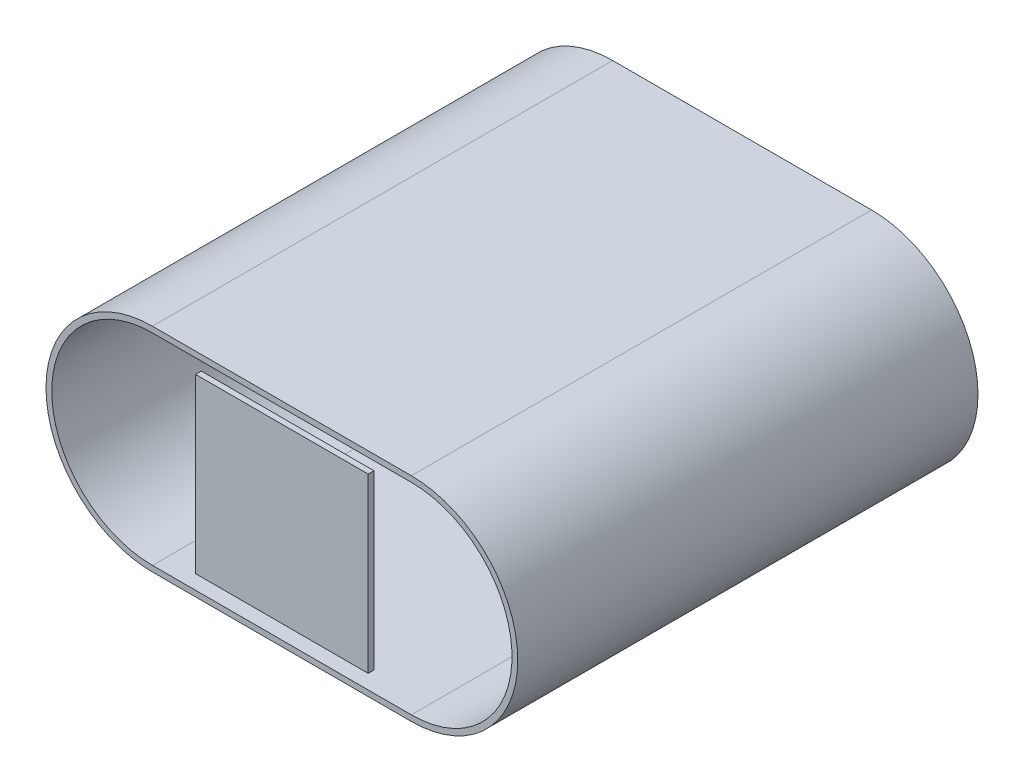
ISO-10303-21;
HEADER;
FILE_DESCRIPTION(('STEP AP214'),'2;1');
FILE_NAME('part.step','',(''),(''),'','','');
FILE_SCHEMA(('AUTOMOTIVE_DESIGN { 1 0 10303 214 1 1 1 1 }'));
ENDSEC;
DATA;
#1=APPLICATION_CONTEXT('core data for automotive mechanical design processes');
#2=APPLICATION_PROTOCOL_DEFINITION('international standard','automotive_design',2000,#1);
#3=PRODUCT_CONTEXT('',#1,'mechanical');
#4=PRODUCT('Part','Part','',(#3));
#5=PRODUCT_RELATED_PRODUCT_CATEGORY('part','',(#4));
#6=PRODUCT_DEFINITION_FORMATION('','',#4);
#7=PRODUCT_DEFINITION_CONTEXT('part definition',#1,'design');
#8=PRODUCT_DEFINITION('design','',#6,#7);
#9=PRODUCT_DEFINITION_SHAPE('','',#8);
#10=(LENGTH_UNIT() NAMED_UNIT(*) SI_UNIT(.MILLI.,.METRE.));
#11=(NAMED_UNIT(*) PLANE_ANGLE_UNIT() SI_UNIT($,.RADIAN.));
#12=(NAMED_UNIT(*) SI_UNIT($,.STERADIAN.) SOLID_ANGLE_UNIT());
#13=UNCERTAINTY_MEASURE_WITH_UNIT(LENGTH_MEASURE(1.E-05),#10,'distance_accuracy_value','');
#14=(GEOMETRIC_REPRESENTATION_CONTEXT(3) GLOBAL_UNCERTAINTY_ASSIGNED_CONTEXT((#13)) GLOBAL_UNIT_ASSIGNED_CONTEXT((#10,
#11,#12)) REPRESENTATION_CONTEXT('',''));
#15=CARTESIAN_POINT('',(0.,0.,0.));
#16=DIRECTION('',(0.,0.,1.));
#17=DIRECTION('',(1.,0.,0.));
#18=AXIS2_PLACEMENT_3D('',#15,#16,#17);
#19=CARTESIAN_POINT('',(15.,-15.,79.));
#20=DIRECTION('',(1.,0.,0.));
#21=DIRECTION('',(0.,0.,-1.));
#22=AXIS2_PLACEMENT_3D('',#19,#20,#21);
#23=PLANE('',#22);
#24=DIRECTION('',(0.,1.,0.));
#25=VECTOR('',#24,1.);
#26=CARTESIAN_POINT('',(15.,-15.,80.));
#27=LINE('',#26,#25);
#28=CARTESIAN_POINT('',(15.,-15.,80.));
#29=VERTEX_POINT('',#28);
#30=CARTESIAN_POINT('',(15.,15.,80.));
#31=VERTEX_POINT('',#30);
#32=EDGE_CURVE('E114',#29,#31,#27,.T.);
#33=ORIENTED_EDGE('',*,*,#32,.F.);
#34=DIRECTION('',(0.,0.,1.));
#35=VECTOR('',#34,1.);
#36=CARTESIAN_POINT('',(15.,-15.,79.));
#37=LINE('',#36,#35);
#38=CARTESIAN_POINT('',(15.,-15.,79.));
#39=VERTEX_POINT('',#38);
#40=EDGE_CURVE('E12',#39,#29,#37,.T.);
#41=ORIENTED_EDGE('',*,*,#40,.F.);
#42=DIRECTION('',(0.,1.,0.));
#43=VECTOR('',#42,1.);
#44=CARTESIAN_POINT('',(15.,-15.,79.));
#45=LINE('',#44,#43);
#46=CARTESIAN_POINT('',(15.,15.,79.));
#47=VERTEX_POINT('',#46);
#48=EDGE_CURVE('E108',#39,#47,#45,.T.);
#49=ORIENTED_EDGE('',*,*,#48,.T.);
#50=DIRECTION('',(0.,0.,1.));
#51=VECTOR('',#50,1.);
#52=CARTESIAN_POINT('',(15.,15.,79.));
#53=LINE('',#52,#51);
#54=EDGE_CURVE('E53',#47,#31,#53,.T.);
#55=ORIENTED_EDGE('',*,*,#54,.T.);
#56=EDGE_LOOP('',(#33,#41,#49,#55));
#57=FACE_BOUND('',#56,.T.);
#58=ADVANCED_FACE('F50',(#57),#23,.T.);
#59=CARTESIAN_POINT('',(-15.,-15.,79.));
#60=DIRECTION('',(0.,-1.,0.));
#61=DIRECTION('',(0.,0.,-1.));
#62=AXIS2_PLACEMENT_3D('',#59,#60,#61);
#63=PLANE('',#62);
#64=DIRECTION('',(1.,0.,0.));
#65=VECTOR('',#64,1.);
#66=CARTESIAN_POINT('',(-15.,-15.,80.));
#67=LINE('',#66,#65);
#68=CARTESIAN_POINT('',(-15.,-15.,80.));
#69=VERTEX_POINT('',#68);
#70=EDGE_CURVE('E110',#69,#29,#67,.T.);
#71=ORIENTED_EDGE('',*,*,#70,.F.);
#72=DIRECTION('',(0.,0.,1.));
#73=VECTOR('',#72,1.);
#74=CARTESIAN_POINT('',(-15.,-15.,79.));
#75=LINE('',#74,#73);
#76=CARTESIAN_POINT('',(-15.,-15.,79.));
#77=VERTEX_POINT('',#76);
#78=EDGE_CURVE('E59',#77,#69,#75,.T.);
#79=ORIENTED_EDGE('',*,*,#78,.F.);
#80=DIRECTION('',(1.,0.,0.));
#81=VECTOR('',#80,1.);
#82=CARTESIAN_POINT('',(-15.,-15.,79.));
#83=LINE('',#82,#81);
#84=EDGE_CURVE('E105',#77,#39,#83,.T.);
#85=ORIENTED_EDGE('',*,*,#84,.T.);
#86=ORIENTED_EDGE('',*,*,#40,.T.);
#87=EDGE_LOOP('',(#71,#79,#85,#86));
#88=FACE_BOUND('',#87,.T.);
#89=ADVANCED_FACE('F124',(#88),#63,.T.);
#90=CARTESIAN_POINT('',(-15.,-15.,79.));
#91=DIRECTION('',(-1.,0.,0.));
#92=DIRECTION('',(0.,-1.,0.));
#93=AXIS2_PLACEMENT_3D('',#90,#91,#92);
#94=PLANE('',#93);
#95=DIRECTION('',(0.,-1.,0.));
#96=VECTOR('',#95,1.);
#97=CARTESIAN_POINT('',(-15.,-15.,80.));
#98=LINE('',#97,#96);
#99=CARTESIAN_POINT('',(-15.,15.,80.));
#100=VERTEX_POINT('',#99);
#101=EDGE_CURVE('E100',#100,#69,#98,.T.);
#102=ORIENTED_EDGE('',*,*,#101,.F.);
#103=DIRECTION('',(0.,0.,1.));
#104=VECTOR('',#103,1.);
#105=CARTESIAN_POINT('',(-15.,15.,79.));
#106=LINE('',#105,#104);
#107=CARTESIAN_POINT('',(-15.,15.,79.));
#108=VERTEX_POINT('',#107);
#109=EDGE_CURVE('E95',#108,#100,#106,.T.);
#110=ORIENTED_EDGE('',*,*,#109,.F.);
#111=DIRECTION('',(0.,-1.,0.));
#112=VECTOR('',#111,1.);
#113=CARTESIAN_POINT('',(-15.,-15.,79.));
#114=LINE('',#113,#112);
#115=EDGE_CURVE('E98',#108,#77,#114,.T.);
#116=ORIENTED_EDGE('',*,*,#115,.T.);
#117=ORIENTED_EDGE('',*,*,#78,.T.);
#118=EDGE_LOOP('',(#102,#110,#116,#117));
#119=FACE_BOUND('',#118,.T.);
#120=ADVANCED_FACE('F97',(#119),#94,.T.);
#121=CARTESIAN_POINT('',(-15.,15.,79.));
#122=DIRECTION('',(0.,1.,0.));
#123=DIRECTION('',(-1.,0.,0.));
#124=AXIS2_PLACEMENT_3D('',#121,#122,#123);
#125=PLANE('',#124);
#126=DIRECTION('',(-1.,0.,0.));
#127=VECTOR('',#126,1.);
#128=CARTESIAN_POINT('',(-15.,15.,80.));
#129=LINE('',#128,#127);
#130=EDGE_CURVE('E117',#31,#100,#129,.T.);
#131=ORIENTED_EDGE('',*,*,#130,.F.);
#132=ORIENTED_EDGE('',*,*,#54,.F.);
#133=DIRECTION('',(-1.,0.,0.));
#134=VECTOR('',#133,1.);
#135=CARTESIAN_POINT('',(-15.,15.,79.));
#136=LINE('',#135,#134);
#137=EDGE_CURVE('E104',#47,#108,#136,.T.);
#138=ORIENTED_EDGE('',*,*,#137,.T.);
#139=ORIENTED_EDGE('',*,*,#109,.T.);
#140=EDGE_LOOP('',(#131,#132,#138,#139));
#141=FACE_BOUND('',#140,.T.);
#142=ADVANCED_FACE('F107',(#141),#125,.T.);
#143=CARTESIAN_POINT('',(0.,0.,79.));
#144=DIRECTION('',(0.,0.,-1.));
#145=DIRECTION('',(-1.,0.,0.));
#146=AXIS2_PLACEMENT_3D('',#143,#144,#145);
#147=PLANE('',#146);
#148=ORIENTED_EDGE('',*,*,#48,.F.);
#149=ORIENTED_EDGE('',*,*,#84,.F.);
#150=ORIENTED_EDGE('',*,*,#115,.F.);
#151=ORIENTED_EDGE('',*,*,#137,.F.);
#152=EDGE_LOOP('',(#148,#149,#150,#151));
#153=FACE_BOUND('',#152,.T.);
#154=ADVANCED_FACE('F103',(#153),#147,.T.);
#155=CARTESIAN_POINT('',(0.,0.,80.));
#156=DIRECTION('',(0.,0.,-1.));
#157=DIRECTION('',(-1.,0.,0.));
#158=AXIS2_PLACEMENT_3D('',#155,#156,#157);
#159=PLANE('',#158);
#160=ORIENTED_EDGE('',*,*,#32,.T.);
#161=ORIENTED_EDGE('',*,*,#130,.T.);
#162=ORIENTED_EDGE('',*,*,#101,.T.);
#163=ORIENTED_EDGE('',*,*,#70,.T.);
#164=EDGE_LOOP('',(#160,#161,#162,#163));
#165=FACE_BOUND('',#164,.T.);
#166=ADVANCED_FACE('F123',(#165),#159,.F.);
#167=CLOSED_SHELL('',(#58,#89,#120,#142,#154,#166));
#168=MANIFOLD_SOLID_BREP('B2',#167);
#169=CARTESIAN_POINT('',(-22.5,-17.5,1.));
#170=DIRECTION('',(-1.,0.,0.));
#171=DIRECTION('',(0.,0.,1.));
#172=AXIS2_PLACEMENT_3D('',#169,#170,#171);
#173=PLANE('',#172);
#174=DIRECTION('',(0.,1.,0.));
#175=VECTOR('',#174,1.);
#176=CARTESIAN_POINT('',(-22.5,-17.5,0.));
#177=LINE('',#176,#175);
#178=CARTESIAN_POINT('',(-22.5,-17.5,0.));
#179=VERTEX_POINT('',#178);
#180=CARTESIAN_POINT('',(-22.5,17.5,0.));
#181=VERTEX_POINT('',#180);
#182=EDGE_CURVE('E247',#179,#181,#177,.T.);
#183=ORIENTED_EDGE('',*,*,#182,.F.);
#184=DIRECTION('',(0.,0.,-1.));
#185=VECTOR('',#184,1.);
#186=CARTESIAN_POINT('',(-22.5,-17.5,1.));
#187=LINE('',#186,#185);
#188=CARTESIAN_POINT('',(-22.5,-17.5,1.));
#189=VERTEX_POINT('',#188);
#190=EDGE_CURVE('E48',#189,#179,#187,.T.);
#191=ORIENTED_EDGE('',*,*,#190,.F.);
#192=DIRECTION('',(0.,1.,0.));
#193=VECTOR('',#192,1.);
#194=CARTESIAN_POINT('',(-22.5,-17.5,1.));
#195=LINE('',#194,#193);
#196=CARTESIAN_POINT('',(-22.5,17.5,1.));
#197=VERTEX_POINT('',#196);
#198=EDGE_CURVE('E241',#189,#197,#195,.T.);
#199=ORIENTED_EDGE('',*,*,#198,.T.);
#200=DIRECTION('',(0.,0.,-1.));
#201=VECTOR('',#200,1.);
#202=CARTESIAN_POINT('',(-22.5,17.5,1.));
#203=LINE('',#202,#201);
#204=EDGE_CURVE('E186',#197,#181,#203,.T.);
#205=ORIENTED_EDGE('',*,*,#204,.T.);
#206=EDGE_LOOP('',(#183,#191,#199,#205));
#207=FACE_BOUND('',#206,.T.);
#208=ADVANCED_FACE('F183',(#207),#173,.T.);
#209=CARTESIAN_POINT('',(22.5,-17.5,1.));
#210=DIRECTION('',(0.,-1.,0.));
#211=DIRECTION('',(0.,0.,-1.));
#212=AXIS2_PLACEMENT_3D('',#209,#210,#211);
#213=PLANE('',#212);
#214=DIRECTION('',(-1.,0.,0.));
#215=VECTOR('',#214,1.);
#216=CARTESIAN_POINT('',(22.5,-17.5,0.));
#217=LINE('',#216,#215);
#218=CARTESIAN_POINT('',(22.5,-17.5,0.));
#219=VERTEX_POINT('',#218);
#220=EDGE_CURVE('E243',#219,#179,#217,.T.);
#221=ORIENTED_EDGE('',*,*,#220,.F.);
#222=DIRECTION('',(0.,0.,-1.));
#223=VECTOR('',#222,1.);
#224=CARTESIAN_POINT('',(22.5,-17.5,1.));
#225=LINE('',#224,#223);
#226=CARTESIAN_POINT('',(22.5,-17.5,1.));
#227=VERTEX_POINT('',#226);
#228=EDGE_CURVE('E192',#227,#219,#225,.T.);
#229=ORIENTED_EDGE('',*,*,#228,.F.);
#230=DIRECTION('',(-1.,0.,0.));
#231=VECTOR('',#230,1.);
#232=CARTESIAN_POINT('',(22.5,-17.5,1.));
#233=LINE('',#232,#231);
#234=EDGE_CURVE('E238',#227,#189,#233,.T.);
#235=ORIENTED_EDGE('',*,*,#234,.T.);
#236=ORIENTED_EDGE('',*,*,#190,.T.);
#237=EDGE_LOOP('',(#221,#229,#235,#236));
#238=FACE_BOUND('',#237,.T.);
#239=ADVANCED_FACE('F257',(#238),#213,.T.);
#240=CARTESIAN_POINT('',(22.5,-17.5,1.));
#241=DIRECTION('',(1.,0.,0.));
#242=DIRECTION('',(0.,1.,0.));
#243=AXIS2_PLACEMENT_3D('',#240,#241,#242);
#244=PLANE('',#243);
#245=DIRECTION('',(0.,-1.,0.));
#246=VECTOR('',#245,1.);
#247=CARTESIAN_POINT('',(22.5,-17.5,0.));
#248=LINE('',#247,#246);
#249=CARTESIAN_POINT('',(22.5,17.5,0.));
#250=VERTEX_POINT('',#249);
#251=EDGE_CURVE('E233',#250,#219,#248,.T.);
#252=ORIENTED_EDGE('',*,*,#251,.F.);
#253=DIRECTION('',(0.,0.,-1.));
#254=VECTOR('',#253,1.);
#255=CARTESIAN_POINT('',(22.5,17.5,1.));
#256=LINE('',#255,#254);
#257=CARTESIAN_POINT('',(22.5,17.5,1.));
#258=VERTEX_POINT('',#257);
#259=EDGE_CURVE('E228',#258,#250,#256,.T.);
#260=ORIENTED_EDGE('',*,*,#259,.F.);
#261=DIRECTION('',(0.,-1.,0.));
#262=VECTOR('',#261,1.);
#263=CARTESIAN_POINT('',(22.5,-17.5,1.));
#264=LINE('',#263,#262);
#265=EDGE_CURVE('E231',#258,#227,#264,.T.);
#266=ORIENTED_EDGE('',*,*,#265,.T.);
#267=ORIENTED_EDGE('',*,*,#228,.T.);
#268=EDGE_LOOP('',(#252,#260,#266,#267));
#269=FACE_BOUND('',#268,.T.);
#270=ADVANCED_FACE('F230',(#269),#244,.T.);
#271=CARTESIAN_POINT('',(22.5,17.5,1.));
#272=DIRECTION('',(0.,1.,0.));
#273=DIRECTION('',(0.,0.,1.));
#274=AXIS2_PLACEMENT_3D('',#271,#272,#273);
#275=PLANE('',#274);
#276=DIRECTION('',(1.,0.,0.));
#277=VECTOR('',#276,1.);
#278=CARTESIAN_POINT('',(22.5,17.5,0.));
#279=LINE('',#278,#277);
#280=EDGE_CURVE('E250',#181,#250,#279,.T.);
#281=ORIENTED_EDGE('',*,*,#280,.F.);
#282=ORIENTED_EDGE('',*,*,#204,.F.);
#283=DIRECTION('',(1.,0.,0.));
#284=VECTOR('',#283,1.);
#285=CARTESIAN_POINT('',(22.5,17.5,1.));
#286=LINE('',#285,#284);
#287=EDGE_CURVE('E237',#197,#258,#286,.T.);
#288=ORIENTED_EDGE('',*,*,#287,.T.);
#289=ORIENTED_EDGE('',*,*,#259,.T.);
#290=EDGE_LOOP('',(#281,#282,#288,#289));
#291=FACE_BOUND('',#290,.T.);
#292=ADVANCED_FACE('F240',(#291),#275,.T.);
#293=CARTESIAN_POINT('',(0.,0.,1.));
#294=DIRECTION('',(0.,0.,1.));
#295=DIRECTION('',(1.,0.,0.));
#296=AXIS2_PLACEMENT_3D('',#293,#294,#295);
#297=PLANE('',#296);
#298=ORIENTED_EDGE('',*,*,#198,.F.);
#299=ORIENTED_EDGE('',*,*,#234,.F.);
#300=ORIENTED_EDGE('',*,*,#265,.F.);
#301=ORIENTED_EDGE('',*,*,#287,.F.);
#302=EDGE_LOOP('',(#298,#299,#300,#301));
#303=FACE_BOUND('',#302,.T.);
#304=ADVANCED_FACE('F236',(#303),#297,.T.);
#305=CARTESIAN_POINT('',(0.,0.,0.));
#306=DIRECTION('',(0.,0.,1.));
#307=DIRECTION('',(1.,0.,0.));
#308=AXIS2_PLACEMENT_3D('',#305,#306,#307);
#309=PLANE('',#308);
#310=ORIENTED_EDGE('',*,*,#182,.T.);
#311=ORIENTED_EDGE('',*,*,#280,.T.);
#312=ORIENTED_EDGE('',*,*,#251,.T.);
#313=ORIENTED_EDGE('',*,*,#220,.T.);
#314=EDGE_LOOP('',(#310,#311,#312,#313));
#315=FACE_BOUND('',#314,.T.);
#316=ADVANCED_FACE('F256',(#315),#309,.F.);
#317=CLOSED_SHELL('',(#208,#239,#270,#292,#304,#316));
#318=MANIFOLD_SOLID_BREP('B6',#317);
#319=CARTESIAN_POINT('',(0.,-18.5,80.));
#320=DIRECTION('',(0.,1.,0.));
#321=DIRECTION('',(0.,0.,1.));
#322=AXIS2_PLACEMENT_3D('',#319,#320,#321);
#323=PLANE('',#322);
#324=DIRECTION('',(1.,0.,0.));
#325=VECTOR('',#324,1.);
#326=CARTESIAN_POINT('',(0.,-18.5,0.));
#327=LINE('',#326,#325);
#328=CARTESIAN_POINT('',(-22.5,-18.5,0.));
#329=VERTEX_POINT('',#328);
#330=CARTESIAN_POINT('',(22.5,-18.5,0.));
#331=VERTEX_POINT('',#330);
#332=EDGE_CURVE('E392',#329,#331,#327,.T.);
#333=ORIENTED_EDGE('',*,*,#332,.T.);
#334=DIRECTION('',(0.,0.,-1.));
#335=VECTOR('',#334,1.);
#336=CARTESIAN_POINT('',(22.5,-18.5,80.));
#337=LINE('',#336,#335);
#338=CARTESIAN_POINT('',(22.5,-18.5,80.));
#339=VERTEX_POINT('',#338);
#340=EDGE_CURVE('E315',#339,#331,#337,.T.);
#341=ORIENTED_EDGE('',*,*,#340,.F.);
#342=DIRECTION('',(1.,0.,0.));
#343=VECTOR('',#342,1.);
#344=CARTESIAN_POINT('',(0.,-18.5,80.));
#345=LINE('',#344,#343);
#346=CARTESIAN_POINT('',(-22.5,-18.5,80.));
#347=VERTEX_POINT('',#346);
#348=EDGE_CURVE('E357',#347,#339,#345,.T.);
#349=ORIENTED_EDGE('',*,*,#348,.F.);
#350=DIRECTION('',(0.,0.,-1.));
#351=VECTOR('',#350,1.);
#352=CARTESIAN_POINT('',(-22.5,-18.5,80.));
#353=LINE('',#352,#351);
#354=EDGE_CURVE('E430',#347,#329,#353,.T.);
#355=ORIENTED_EDGE('',*,*,#354,.T.);
#356=EDGE_LOOP('',(#333,#341,#349,#355));
#357=FACE_BOUND('',#356,.T.);
#358=ADVANCED_FACE('F307',(#357),#323,.F.);
#359=CARTESIAN_POINT('',(22.5,0.,80.));
#360=DIRECTION('',(0.,0.,-1.));
#361=DIRECTION('',(-1.,0.,0.));
#362=AXIS2_PLACEMENT_3D('',#359,#360,#361);
#363=CYLINDRICAL_SURFACE('',#362,18.5);
#364=CARTESIAN_POINT('',(22.5,0.,0.));
#365=DIRECTION('',(0.,0.,1.));
#366=DIRECTION('',(1.,0.,0.));
#367=AXIS2_PLACEMENT_3D('',#364,#365,#366);
#368=CIRCLE('',#367,18.5);
#369=CARTESIAN_POINT('',(22.5,18.5,0.));
#370=VERTEX_POINT('',#369);
#371=EDGE_CURVE('E433',#370,#331,#368,.F.);
#372=ORIENTED_EDGE('',*,*,#371,.F.);
#373=DIRECTION('',(0.,0.,-1.));
#374=VECTOR('',#373,1.);
#375=CARTESIAN_POINT('',(22.5,18.5,80.));
#376=LINE('',#375,#374);
#377=CARTESIAN_POINT('',(22.5,18.5,80.));
#378=VERTEX_POINT('',#377);
#379=EDGE_CURVE('E443',#378,#370,#376,.T.);
#380=ORIENTED_EDGE('',*,*,#379,.F.);
#381=CARTESIAN_POINT('',(22.5,0.,80.));
#382=DIRECTION('',(0.,0.,1.));
#383=DIRECTION('',(1.,0.,0.));
#384=AXIS2_PLACEMENT_3D('',#381,#382,#383);
#385=CIRCLE('',#384,18.5);
#386=EDGE_CURVE('E423',#378,#339,#385,.F.);
#387=ORIENTED_EDGE('',*,*,#386,.T.);
#388=ORIENTED_EDGE('',*,*,#340,.T.);
#389=EDGE_LOOP('',(#372,#380,#387,#388));
#390=FACE_BOUND('',#389,.T.);
#391=ADVANCED_FACE('F447',(#390),#363,.T.);
#392=CARTESIAN_POINT('',(0.,18.5,80.));
#393=DIRECTION('',(0.,1.,0.));
#394=DIRECTION('',(0.,0.,1.));
#395=AXIS2_PLACEMENT_3D('',#392,#393,#394);
#396=PLANE('',#395);
#397=DIRECTION('',(1.,0.,0.));
#398=VECTOR('',#397,1.);
#399=CARTESIAN_POINT('',(0.,18.5,0.));
#400=LINE('',#399,#398);
#401=CARTESIAN_POINT('',(-22.5,18.5,0.));
#402=VERTEX_POINT('',#401);
#403=EDGE_CURVE('E436',#402,#370,#400,.T.);
#404=ORIENTED_EDGE('',*,*,#403,.F.);
#405=DIRECTION('',(0.,0.,-1.));
#406=VECTOR('',#405,1.);
#407=CARTESIAN_POINT('',(-22.5,18.5,80.));
#408=LINE('',#407,#406);
#409=CARTESIAN_POINT('',(-22.5,18.5,80.));
#410=VERTEX_POINT('',#409);
#411=EDGE_CURVE('E441',#410,#402,#408,.T.);
#412=ORIENTED_EDGE('',*,*,#411,.F.);
#413=DIRECTION('',(1.,0.,0.));
#414=VECTOR('',#413,1.);
#415=CARTESIAN_POINT('',(0.,18.5,80.));
#416=LINE('',#415,#414);
#417=EDGE_CURVE('E426',#410,#378,#416,.T.);
#418=ORIENTED_EDGE('',*,*,#417,.T.);
#419=ORIENTED_EDGE('',*,*,#379,.T.);
#420=EDGE_LOOP('',(#404,#412,#418,#419));
#421=FACE_BOUND('',#420,.T.);
#422=ADVANCED_FACE('F455',(#421),#396,.T.);
#423=CARTESIAN_POINT('',(-22.5,0.,80.));
#424=DIRECTION('',(0.,0.,-1.));
#425=DIRECTION('',(-1.,0.,0.));
#426=AXIS2_PLACEMENT_3D('',#423,#424,#425);
#427=CYLINDRICAL_SURFACE('',#426,18.5);
#428=CARTESIAN_POINT('',(-22.5,0.,0.));
#429=DIRECTION('',(0.,0.,1.));
#430=DIRECTION('',(1.,0.,0.));
#431=AXIS2_PLACEMENT_3D('',#428,#429,#430);
#432=CIRCLE('',#431,18.5);
#433=EDGE_CURVE('E352',#402,#329,#432,.T.);
#434=ORIENTED_EDGE('',*,*,#433,.T.);
#435=ORIENTED_EDGE('',*,*,#354,.F.);
#436=CARTESIAN_POINT('',(-22.5,0.,80.));
#437=DIRECTION('',(0.,0.,1.));
#438=DIRECTION('',(1.,0.,0.));
#439=AXIS2_PLACEMENT_3D('',#436,#437,#438);
#440=CIRCLE('',#439,18.5);
#441=EDGE_CURVE('E331',#410,#347,#440,.T.);
#442=ORIENTED_EDGE('',*,*,#441,.F.);
#443=ORIENTED_EDGE('',*,*,#411,.T.);
#444=EDGE_LOOP('',(#434,#435,#442,#443));
#445=FACE_BOUND('',#444,.T.);
#446=ADVANCED_FACE('F458',(#445),#427,.T.);
#447=CARTESIAN_POINT('',(0.,0.,80.));
#448=DIRECTION('',(0.,0.,1.));
#449=DIRECTION('',(1.,0.,0.));
#450=AXIS2_PLACEMENT_3D('',#447,#448,#449);
#451=PLANE('',#450);
#452=DIRECTION('',(1.,0.,0.));
#453=VECTOR('',#452,1.);
#454=CARTESIAN_POINT('',(0.,-17.5,80.));
#455=LINE('',#454,#453);
#456=CARTESIAN_POINT('',(-22.5,-17.5,80.));
#457=VERTEX_POINT('',#456);
#458=CARTESIAN_POINT('',(22.5,-17.5,80.));
#459=VERTEX_POINT('',#458);
#460=EDGE_CURVE('E387',#457,#459,#455,.T.);
#461=ORIENTED_EDGE('',*,*,#460,.F.);
#462=CARTESIAN_POINT('',(-22.5,0.,80.));
#463=DIRECTION('',(0.,0.,1.));
#464=DIRECTION('',(1.,0.,0.));
#465=AXIS2_PLACEMENT_3D('',#462,#463,#464);
#466=CIRCLE('',#465,17.5);
#467=CARTESIAN_POINT('',(-22.5,17.5,80.));
#468=VERTEX_POINT('',#467);
#469=EDGE_CURVE('E420',#468,#457,#466,.T.);
#470=ORIENTED_EDGE('',*,*,#469,.F.);
#471=DIRECTION('',(1.,0.,0.));
#472=VECTOR('',#471,1.);
#473=CARTESIAN_POINT('',(0.,17.5,80.));
#474=LINE('',#473,#472);
#475=CARTESIAN_POINT('',(22.5,17.5,80.));
#476=VERTEX_POINT('',#475);
#477=EDGE_CURVE('E322',#468,#476,#474,.T.);
#478=ORIENTED_EDGE('',*,*,#477,.T.);
#479=CARTESIAN_POINT('',(22.5,0.,80.));
#480=DIRECTION('',(0.,0.,1.));
#481=DIRECTION('',(1.,0.,0.));
#482=AXIS2_PLACEMENT_3D('',#479,#480,#481);
#483=CIRCLE('',#482,17.5);
#484=EDGE_CURVE('E417',#476,#459,#483,.F.);
#485=ORIENTED_EDGE('',*,*,#484,.T.);
#486=EDGE_LOOP('',(#461,#470,#478,#485));
#487=FACE_BOUND('',#486,.T.);
#488=ORIENTED_EDGE('',*,*,#348,.T.);
#489=ORIENTED_EDGE('',*,*,#386,.F.);
#490=ORIENTED_EDGE('',*,*,#417,.F.);
#491=ORIENTED_EDGE('',*,*,#441,.T.);
#492=EDGE_LOOP('',(#488,#489,#490,#491));
#493=FACE_BOUND('',#492,.T.);
#494=ADVANCED_FACE('F456',(#487,#493),#451,.T.);
#495=CARTESIAN_POINT('',(0.,0.,0.));
#496=DIRECTION('',(0.,0.,1.));
#497=DIRECTION('',(1.,0.,0.));
#498=AXIS2_PLACEMENT_3D('',#495,#496,#497);
#499=PLANE('',#498);
#500=ORIENTED_EDGE('',*,*,#332,.F.);
#501=ORIENTED_EDGE('',*,*,#433,.F.);
#502=ORIENTED_EDGE('',*,*,#403,.T.);
#503=ORIENTED_EDGE('',*,*,#371,.T.);
#504=EDGE_LOOP('',(#500,#501,#502,#503));
#505=FACE_BOUND('',#504,.T.);
#506=CARTESIAN_POINT('',(0.,0.,0.));
#507=DIRECTION('',(0.,0.,1.));
#508=DIRECTION('',(1.,0.,0.));
#509=AXIS2_PLACEMENT_3D('',#506,#507,#508);
#510=CIRCLE('',#509,1.25);
#511=CARTESIAN_POINT('',(1.25,0.,0.));
#512=VERTEX_POINT('',#511);
#513=EDGE_CURVE('E181',#512,#512,#510,.F.);
#514=ORIENTED_EDGE('',*,*,#513,.F.);
#515=EDGE_LOOP('',(#514));
#516=FACE_BOUND('',#515,.T.);
#517=ADVANCED_FACE('F451',(#505,#516),#499,.F.);
#518=CARTESIAN_POINT('',(0.,-17.5,80.));
#519=DIRECTION('',(0.,1.,0.));
#520=DIRECTION('',(0.,0.,1.));
#521=AXIS2_PLACEMENT_3D('',#518,#519,#520);
#522=PLANE('',#521);
#523=DIRECTION('',(1.,0.,0.));
#524=VECTOR('',#523,1.);
#525=CARTESIAN_POINT('',(0.,-17.5,1.));
#526=LINE('',#525,#524);
#527=CARTESIAN_POINT('',(-22.5,-17.5,1.));
#528=VERTEX_POINT('',#527);
#529=CARTESIAN_POINT('',(22.5,-17.5,1.));
#530=VERTEX_POINT('',#529);
#531=EDGE_CURVE('E385',#528,#530,#526,.T.);
#532=ORIENTED_EDGE('',*,*,#531,.F.);
#533=DIRECTION('',(0.,0.,1.));
#534=VECTOR('',#533,1.);
#535=CARTESIAN_POINT('',(-22.5,-17.5,80.));
#536=LINE('',#535,#534);
#537=EDGE_CURVE('E411',#457,#528,#536,.F.);
#538=ORIENTED_EDGE('',*,*,#537,.F.);
#539=ORIENTED_EDGE('',*,*,#460,.T.);
#540=DIRECTION('',(0.,0.,-1.));
#541=VECTOR('',#540,1.);
#542=CARTESIAN_POINT('',(22.5,-17.5,80.));
#543=LINE('',#542,#541);
#544=EDGE_CURVE('E381',#459,#530,#543,.T.);
#545=ORIENTED_EDGE('',*,*,#544,.T.);
#546=EDGE_LOOP('',(#532,#538,#539,#545));
#547=FACE_BOUND('',#546,.T.);
#548=ADVANCED_FACE('F383',(#547),#522,.T.);
#549=CARTESIAN_POINT('',(22.5,0.,80.));
#550=DIRECTION('',(0.,0.,-1.));
#551=DIRECTION('',(-1.,0.,0.));
#552=AXIS2_PLACEMENT_3D('',#549,#550,#551);
#553=CYLINDRICAL_SURFACE('',#552,17.5);
#554=CARTESIAN_POINT('',(22.5,0.,1.));
#555=DIRECTION('',(0.,0.,1.));
#556=DIRECTION('',(1.,0.,0.));
#557=AXIS2_PLACEMENT_3D('',#554,#555,#556);
#558=CIRCLE('',#557,17.5);
#559=CARTESIAN_POINT('',(22.5,17.5,1.));
#560=VERTEX_POINT('',#559);
#561=EDGE_CURVE('E399',#560,#530,#558,.F.);
#562=ORIENTED_EDGE('',*,*,#561,.T.);
#563=ORIENTED_EDGE('',*,*,#544,.F.);
#564=ORIENTED_EDGE('',*,*,#484,.F.);
#565=DIRECTION('',(0.,0.,1.));
#566=VECTOR('',#565,1.);
#567=CARTESIAN_POINT('',(22.5,17.5,80.));
#568=LINE('',#567,#566);
#569=EDGE_CURVE('E393',#476,#560,#568,.F.);
#570=ORIENTED_EDGE('',*,*,#569,.T.);
#571=EDGE_LOOP('',(#562,#563,#564,#570));
#572=FACE_BOUND('',#571,.T.);
#573=ADVANCED_FACE('F405',(#572),#553,.F.);
#574=CARTESIAN_POINT('',(0.,17.5,80.));
#575=DIRECTION('',(0.,1.,0.));
#576=DIRECTION('',(0.,0.,1.));
#577=AXIS2_PLACEMENT_3D('',#574,#575,#576);
#578=PLANE('',#577);
#579=DIRECTION('',(1.,0.,0.));
#580=VECTOR('',#579,1.);
#581=CARTESIAN_POINT('',(0.,17.5,1.));
#582=LINE('',#581,#580);
#583=CARTESIAN_POINT('',(-22.5,17.5,1.));
#584=VERTEX_POINT('',#583);
#585=EDGE_CURVE('E406',#584,#560,#582,.T.);
#586=ORIENTED_EDGE('',*,*,#585,.T.);
#587=ORIENTED_EDGE('',*,*,#569,.F.);
#588=ORIENTED_EDGE('',*,*,#477,.F.);
#589=DIRECTION('',(0.,0.,-1.));
#590=VECTOR('',#589,1.);
#591=CARTESIAN_POINT('',(-22.5,17.5,80.));
#592=LINE('',#591,#590);
#593=EDGE_CURVE('E412',#468,#584,#592,.T.);
#594=ORIENTED_EDGE('',*,*,#593,.T.);
#595=EDGE_LOOP('',(#586,#587,#588,#594));
#596=FACE_BOUND('',#595,.T.);
#597=ADVANCED_FACE('F507',(#596),#578,.F.);
#598=CARTESIAN_POINT('',(-22.5,0.,80.));
#599=DIRECTION('',(0.,0.,-1.));
#600=DIRECTION('',(-1.,0.,0.));
#601=AXIS2_PLACEMENT_3D('',#598,#599,#600);
#602=CYLINDRICAL_SURFACE('',#601,17.5);
#603=CARTESIAN_POINT('',(-22.5,0.,1.));
#604=DIRECTION('',(0.,0.,1.));
#605=DIRECTION('',(1.,0.,0.));
#606=AXIS2_PLACEMENT_3D('',#603,#604,#605);
#607=CIRCLE('',#606,17.5);
#608=EDGE_CURVE('E402',#584,#528,#607,.T.);
#609=ORIENTED_EDGE('',*,*,#608,.F.);
#610=ORIENTED_EDGE('',*,*,#593,.F.);
#611=ORIENTED_EDGE('',*,*,#469,.T.);
#612=ORIENTED_EDGE('',*,*,#537,.T.);
#613=EDGE_LOOP('',(#609,#610,#611,#612));
#614=FACE_BOUND('',#613,.T.);
#615=ADVANCED_FACE('F516',(#614),#602,.F.);
#616=CARTESIAN_POINT('',(0.,0.,1.));
#617=DIRECTION('',(0.,0.,1.));
#618=DIRECTION('',(1.,0.,0.));
#619=AXIS2_PLACEMENT_3D('',#616,#617,#618);
#620=PLANE('',#619);
#621=ORIENTED_EDGE('',*,*,#585,.F.);
#622=ORIENTED_EDGE('',*,*,#608,.T.);
#623=ORIENTED_EDGE('',*,*,#531,.T.);
#624=ORIENTED_EDGE('',*,*,#561,.F.);
#625=EDGE_LOOP('',(#621,#622,#623,#624));
#626=FACE_BOUND('',#625,.T.);
#627=ADVANCED_FACE('F398',(#626),#620,.T.);
#628=CARTESIAN_POINT('',(0.,0.,-15.));
#629=DIRECTION('',(0.,0.,1.));
#630=DIRECTION('',(1.,0.,0.));
#631=AXIS2_PLACEMENT_3D('',#628,#629,#630);
#632=CYLINDRICAL_SURFACE('',#631,1.25);
#633=CARTESIAN_POINT('',(0.,0.,-12.8365737252465));
#634=DIRECTION('',(0.,0.,-1.));
#635=DIRECTION('',(-1.,0.,0.));
#636=AXIS2_PLACEMENT_3D('',#633,#634,#635);
#637=CIRCLE('',#636,1.25);
#638=CARTESIAN_POINT('',(-1.25,0.,-12.8365737252465));
#639=VERTEX_POINT('',#638);
#640=EDGE_CURVE('E310',#639,#639,#637,.F.);
#641=ORIENTED_EDGE('',*,*,#640,.T.);
#642=EDGE_LOOP('',(#641));
#643=FACE_BOUND('',#642,.T.);
#644=ORIENTED_EDGE('',*,*,#513,.T.);
#645=EDGE_LOOP('',(#644));
#646=FACE_BOUND('',#645,.T.);
#647=ADVANCED_FACE('F541',(#643,#646),#632,.T.);
#648=CARTESIAN_POINT('',(0.,0.,-15.));
#649=DIRECTION('',(0.,1.,0.));
#650=DIRECTION('',(-1.,0.,0.));
#651=AXIS2_PLACEMENT_3D('',#648,#649,#650);
#652=SPHERICAL_SURFACE('',#651,2.49858224725422);
#653=CARTESIAN_POINT('',(0.,0.,-15.));
#654=DIRECTION('',(0.,0.,-1.));
#655=DIRECTION('',(-1.,0.,0.));
#656=AXIS2_PLACEMENT_3D('',#653,#654,#655);
#657=SPHERICAL_SURFACE('',#656,2.49858224725422);
#658=ORIENTED_EDGE('',*,*,#640,.F.);
#659=EDGE_LOOP('',(#658));
#660=FACE_BOUND('',#659,.T.);
#661=ADVANCED_FACE('F550',(#660),#657,.T.);
#662=CLOSED_SHELL('',(#358,#391,#422,#446,#494,#517,#548,#573,#597,#615,#627,#647,#661));
#663=MANIFOLD_SOLID_BREP('B42',#662);
#664=ADVANCED_BREP_SHAPE_REPRESENTATION('',(#18,#168,#318,#663),#14);
#665=SHAPE_DEFINITION_REPRESENTATION(#9,#664);
ENDSEC;
END-ISO-10303-21;
